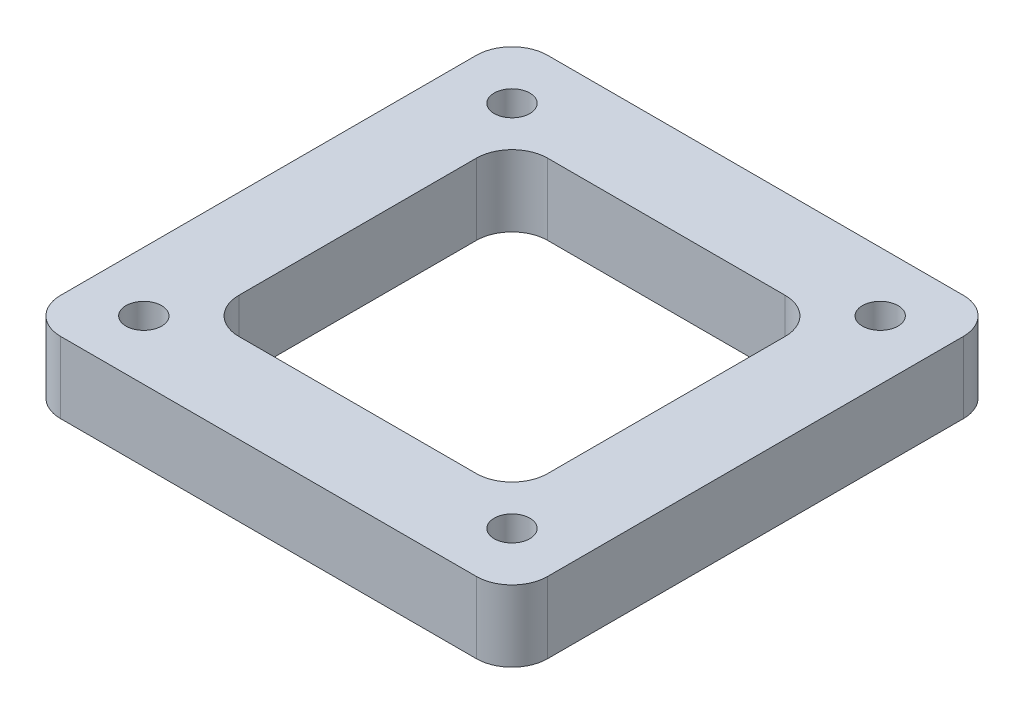
ISO-10303-21;
HEADER;
FILE_DESCRIPTION(('STEP AP214'),'2;1');
FILE_NAME('part.step','',(''),(''),'','','');
FILE_SCHEMA(('AUTOMOTIVE_DESIGN { 1 0 10303 214 1 1 1 1 }'));
ENDSEC;
DATA;
#1=APPLICATION_CONTEXT('core data for automotive mechanical design processes');
#2=APPLICATION_PROTOCOL_DEFINITION('international standard','automotive_design',2000,#1);
#3=PRODUCT_CONTEXT('',#1,'mechanical');
#4=PRODUCT('Part','Part','',(#3));
#5=PRODUCT_RELATED_PRODUCT_CATEGORY('part','',(#4));
#6=PRODUCT_DEFINITION_FORMATION('','',#4);
#7=PRODUCT_DEFINITION_CONTEXT('part definition',#1,'design');
#8=PRODUCT_DEFINITION('design','',#6,#7);
#9=PRODUCT_DEFINITION_SHAPE('','',#8);
#10=(LENGTH_UNIT() NAMED_UNIT(*) SI_UNIT(.MILLI.,.METRE.));
#11=(NAMED_UNIT(*) PLANE_ANGLE_UNIT() SI_UNIT($,.RADIAN.));
#12=(NAMED_UNIT(*) SI_UNIT($,.STERADIAN.) SOLID_ANGLE_UNIT());
#13=UNCERTAINTY_MEASURE_WITH_UNIT(LENGTH_MEASURE(1.E-05),#10,'distance_accuracy_value','');
#14=(GEOMETRIC_REPRESENTATION_CONTEXT(3) GLOBAL_UNCERTAINTY_ASSIGNED_CONTEXT((#13)) GLOBAL_UNIT_ASSIGNED_CONTEXT((#10,
#11,#12)) REPRESENTATION_CONTEXT('',''));
#15=CARTESIAN_POINT('',(0.,0.,0.));
#16=DIRECTION('',(0.,0.,1.));
#17=DIRECTION('',(1.,0.,0.));
#18=AXIS2_PLACEMENT_3D('',#15,#16,#17);
#19=CARTESIAN_POINT('',(0.,6.,0.));
#20=DIRECTION('',(0.,1.,0.));
#21=DIRECTION('',(0.,0.,1.));
#22=AXIS2_PLACEMENT_3D('',#19,#20,#21);
#23=PLANE('',#22);
#24=CARTESIAN_POINT('',(15.5,6.,-15.5));
#25=DIRECTION('',(0.,1.,0.));
#26=DIRECTION('',(0.,0.,1.));
#27=AXIS2_PLACEMENT_3D('',#24,#25,#26);
#28=CIRCLE('',#27,1.5);
#29=CARTESIAN_POINT('',(15.5,6.,-14.));
#30=VERTEX_POINT('',#29);
#31=EDGE_CURVE('E336',#30,#30,#28,.T.);
#32=ORIENTED_EDGE('',*,*,#31,.F.);
#33=EDGE_LOOP('',(#32));
#34=FACE_BOUND('',#33,.T.);
#35=CARTESIAN_POINT('',(-15.5,6.,15.5));
#36=DIRECTION('',(0.,1.,0.));
#37=DIRECTION('',(0.,0.,1.));
#38=AXIS2_PLACEMENT_3D('',#35,#36,#37);
#39=CIRCLE('',#38,1.5);
#40=CARTESIAN_POINT('',(-15.5,6.,17.));
#41=VERTEX_POINT('',#40);
#42=EDGE_CURVE('E327',#41,#41,#39,.T.);
#43=ORIENTED_EDGE('',*,*,#42,.F.);
#44=EDGE_LOOP('',(#43));
#45=FACE_BOUND('',#44,.T.);
#46=CARTESIAN_POINT('',(15.5,6.,15.5));
#47=DIRECTION('',(0.,1.,0.));
#48=DIRECTION('',(0.,0.,1.));
#49=AXIS2_PLACEMENT_3D('',#46,#47,#48);
#50=CIRCLE('',#49,1.5);
#51=CARTESIAN_POINT('',(15.5,6.,17.));
#52=VERTEX_POINT('',#51);
#53=EDGE_CURVE('E317',#52,#52,#50,.T.);
#54=ORIENTED_EDGE('',*,*,#53,.F.);
#55=EDGE_LOOP('',(#54));
#56=FACE_BOUND('',#55,.T.);
#57=CARTESIAN_POINT('',(-15.5,6.,-15.5));
#58=DIRECTION('',(0.,1.,0.));
#59=DIRECTION('',(0.,0.,1.));
#60=AXIS2_PLACEMENT_3D('',#57,#58,#59);
#61=CIRCLE('',#60,1.5);
#62=CARTESIAN_POINT('',(-15.5,6.,-14.));
#63=VERTEX_POINT('',#62);
#64=EDGE_CURVE('E347',#63,#63,#61,.T.);
#65=ORIENTED_EDGE('',*,*,#64,.F.);
#66=EDGE_LOOP('',(#65));
#67=FACE_BOUND('',#66,.T.);
#68=DIRECTION('',(0.,0.,-1.));
#69=VECTOR('',#68,1.);
#70=CARTESIAN_POINT('',(20.5,6.,-20.5));
#71=LINE('',#70,#69);
#72=CARTESIAN_POINT('',(20.5,6.,17.5));
#73=VERTEX_POINT('',#72);
#74=CARTESIAN_POINT('',(20.5,6.,-17.5));
#75=VERTEX_POINT('',#74);
#76=EDGE_CURVE('E355',#73,#75,#71,.T.);
#77=ORIENTED_EDGE('',*,*,#76,.T.);
#78=CARTESIAN_POINT('',(17.5,6.,-17.5));
#79=DIRECTION('',(0.,1.,0.));
#80=DIRECTION('',(0.,0.,1.));
#81=AXIS2_PLACEMENT_3D('',#78,#79,#80);
#82=CIRCLE('',#81,3.);
#83=CARTESIAN_POINT('',(17.5,6.,-20.5));
#84=VERTEX_POINT('',#83);
#85=EDGE_CURVE('E251',#75,#84,#82,.T.);
#86=ORIENTED_EDGE('',*,*,#85,.T.);
#87=DIRECTION('',(-1.,0.,0.));
#88=VECTOR('',#87,1.);
#89=CARTESIAN_POINT('',(-20.5,6.,-20.5));
#90=LINE('',#89,#88);
#91=CARTESIAN_POINT('',(-17.5,6.,-20.5));
#92=VERTEX_POINT('',#91);
#93=EDGE_CURVE('E359',#84,#92,#90,.T.);
#94=ORIENTED_EDGE('',*,*,#93,.T.);
#95=CARTESIAN_POINT('',(-17.5,6.,-17.5));
#96=DIRECTION('',(0.,1.,0.));
#97=DIRECTION('',(0.,0.,1.));
#98=AXIS2_PLACEMENT_3D('',#95,#96,#97);
#99=CIRCLE('',#98,3.);
#100=CARTESIAN_POINT('',(-20.5,6.,-17.5));
#101=VERTEX_POINT('',#100);
#102=EDGE_CURVE('E245',#92,#101,#99,.T.);
#103=ORIENTED_EDGE('',*,*,#102,.T.);
#104=DIRECTION('',(0.,0.,1.));
#105=VECTOR('',#104,1.);
#106=CARTESIAN_POINT('',(-20.5,6.,-20.5));
#107=LINE('',#106,#105);
#108=CARTESIAN_POINT('',(-20.5,6.,17.5));
#109=VERTEX_POINT('',#108);
#110=EDGE_CURVE('E192',#101,#109,#107,.T.);
#111=ORIENTED_EDGE('',*,*,#110,.T.);
#112=CARTESIAN_POINT('',(-17.5,6.,17.5));
#113=DIRECTION('',(0.,1.,0.));
#114=DIRECTION('',(0.,0.,1.));
#115=AXIS2_PLACEMENT_3D('',#112,#113,#114);
#116=CIRCLE('',#115,3.);
#117=CARTESIAN_POINT('',(-17.5,6.,20.5));
#118=VERTEX_POINT('',#117);
#119=EDGE_CURVE('E66',#109,#118,#116,.T.);
#120=ORIENTED_EDGE('',*,*,#119,.T.);
#121=DIRECTION('',(1.,0.,0.));
#122=VECTOR('',#121,1.);
#123=CARTESIAN_POINT('',(-20.5,6.,20.5));
#124=LINE('',#123,#122);
#125=CARTESIAN_POINT('',(17.5,6.,20.5));
#126=VERTEX_POINT('',#125);
#127=EDGE_CURVE('E186',#118,#126,#124,.T.);
#128=ORIENTED_EDGE('',*,*,#127,.T.);
#129=CARTESIAN_POINT('',(17.5,6.,17.5));
#130=DIRECTION('',(0.,1.,0.));
#131=DIRECTION('',(0.,0.,1.));
#132=AXIS2_PLACEMENT_3D('',#129,#130,#131);
#133=CIRCLE('',#132,3.);
#134=EDGE_CURVE('E248',#126,#73,#133,.T.);
#135=ORIENTED_EDGE('',*,*,#134,.T.);
#136=EDGE_LOOP('',(#77,#86,#94,#103,#111,#120,#128,#135));
#137=FACE_BOUND('',#136,.T.);
#138=DIRECTION('',(-1.,0.,0.));
#139=VECTOR('',#138,1.);
#140=CARTESIAN_POINT('',(-13.,6.,-13.));
#141=LINE('',#140,#139);
#142=CARTESIAN_POINT('',(9.99999999999999,6.,-13.));
#143=VERTEX_POINT('',#142);
#144=CARTESIAN_POINT('',(-10.,6.,-13.));
#145=VERTEX_POINT('',#144);
#146=EDGE_CURVE('E300',#143,#145,#141,.T.);
#147=ORIENTED_EDGE('',*,*,#146,.F.);
#148=CARTESIAN_POINT('',(9.99999999999999,6.,-10.));
#149=DIRECTION('',(0.,1.,0.));
#150=DIRECTION('',(0.,0.,1.));
#151=AXIS2_PLACEMENT_3D('',#148,#149,#150);
#152=CIRCLE('',#151,3.);
#153=CARTESIAN_POINT('',(13.,6.,-10.));
#154=VERTEX_POINT('',#153);
#155=EDGE_CURVE('E170',#143,#154,#152,.F.);
#156=ORIENTED_EDGE('',*,*,#155,.T.);
#157=DIRECTION('',(0.,0.,-1.));
#158=VECTOR('',#157,1.);
#159=CARTESIAN_POINT('',(13.,6.,-13.));
#160=LINE('',#159,#158);
#161=CARTESIAN_POINT('',(13.,6.,9.99999999999999));
#162=VERTEX_POINT('',#161);
#163=EDGE_CURVE('E307',#162,#154,#160,.T.);
#164=ORIENTED_EDGE('',*,*,#163,.F.);
#165=CARTESIAN_POINT('',(9.99999999999999,6.,10.));
#166=DIRECTION('',(0.,1.,0.));
#167=DIRECTION('',(0.,0.,1.));
#168=AXIS2_PLACEMENT_3D('',#165,#166,#167);
#169=CIRCLE('',#168,3.);
#170=CARTESIAN_POINT('',(9.99999999999999,6.,13.));
#171=VERTEX_POINT('',#170);
#172=EDGE_CURVE('E169',#162,#171,#169,.F.);
#173=ORIENTED_EDGE('',*,*,#172,.T.);
#174=DIRECTION('',(1.,0.,0.));
#175=VECTOR('',#174,1.);
#176=CARTESIAN_POINT('',(-13.,6.,13.));
#177=LINE('',#176,#175);
#178=CARTESIAN_POINT('',(-10.,6.,13.));
#179=VERTEX_POINT('',#178);
#180=EDGE_CURVE('E311',#179,#171,#177,.T.);
#181=ORIENTED_EDGE('',*,*,#180,.F.);
#182=CARTESIAN_POINT('',(-10.,6.,10.));
#183=DIRECTION('',(0.,1.,0.));
#184=DIRECTION('',(0.,0.,1.));
#185=AXIS2_PLACEMENT_3D('',#182,#183,#184);
#186=CIRCLE('',#185,3.);
#187=CARTESIAN_POINT('',(-13.,6.,9.99999999999999));
#188=VERTEX_POINT('',#187);
#189=EDGE_CURVE('E277',#179,#188,#186,.F.);
#190=ORIENTED_EDGE('',*,*,#189,.T.);
#191=DIRECTION('',(0.,0.,1.));
#192=VECTOR('',#191,1.);
#193=CARTESIAN_POINT('',(-13.,6.,-13.));
#194=LINE('',#193,#192);
#195=CARTESIAN_POINT('',(-13.,6.,-10.));
#196=VERTEX_POINT('',#195);
#197=EDGE_CURVE('E302',#196,#188,#194,.T.);
#198=ORIENTED_EDGE('',*,*,#197,.F.);
#199=CARTESIAN_POINT('',(-10.,6.,-10.));
#200=DIRECTION('',(0.,1.,0.));
#201=DIRECTION('',(0.,0.,1.));
#202=AXIS2_PLACEMENT_3D('',#199,#200,#201);
#203=CIRCLE('',#202,3.);
#204=EDGE_CURVE('E11',#196,#145,#203,.F.);
#205=ORIENTED_EDGE('',*,*,#204,.T.);
#206=EDGE_LOOP('',(#147,#156,#164,#173,#181,#190,#198,#205));
#207=FACE_BOUND('',#206,.T.);
#208=ADVANCED_FACE('F43',(#34,#45,#56,#67,#137,#207),#23,.T.);
#209=CARTESIAN_POINT('',(0.,0.,0.));
#210=DIRECTION('',(0.,1.,0.));
#211=DIRECTION('',(0.,0.,1.));
#212=AXIS2_PLACEMENT_3D('',#209,#210,#211);
#213=PLANE('',#212);
#214=DIRECTION('',(-1.,0.,0.));
#215=VECTOR('',#214,1.);
#216=CARTESIAN_POINT('',(-20.5,0.,-20.5));
#217=LINE('',#216,#215);
#218=CARTESIAN_POINT('',(17.5,0.,-20.5));
#219=VERTEX_POINT('',#218);
#220=CARTESIAN_POINT('',(-17.5,0.,-20.5));
#221=VERTEX_POINT('',#220);
#222=EDGE_CURVE('E368',#219,#221,#217,.T.);
#223=ORIENTED_EDGE('',*,*,#222,.F.);
#224=CARTESIAN_POINT('',(17.5,0.,-17.5));
#225=DIRECTION('',(0.,1.,0.));
#226=DIRECTION('',(0.,0.,1.));
#227=AXIS2_PLACEMENT_3D('',#224,#225,#226);
#228=CIRCLE('',#227,3.);
#229=CARTESIAN_POINT('',(20.5,0.,-17.5));
#230=VERTEX_POINT('',#229);
#231=EDGE_CURVE('E233',#219,#230,#228,.F.);
#232=ORIENTED_EDGE('',*,*,#231,.T.);
#233=DIRECTION('',(0.,0.,-1.));
#234=VECTOR('',#233,1.);
#235=CARTESIAN_POINT('',(20.5,0.,-20.5));
#236=LINE('',#235,#234);
#237=CARTESIAN_POINT('',(20.5,0.,17.5));
#238=VERTEX_POINT('',#237);
#239=EDGE_CURVE('E351',#238,#230,#236,.T.);
#240=ORIENTED_EDGE('',*,*,#239,.F.);
#241=CARTESIAN_POINT('',(17.5,0.,17.5));
#242=DIRECTION('',(0.,1.,0.));
#243=DIRECTION('',(0.,0.,1.));
#244=AXIS2_PLACEMENT_3D('',#241,#242,#243);
#245=CIRCLE('',#244,3.);
#246=CARTESIAN_POINT('',(17.5,0.,20.5));
#247=VERTEX_POINT('',#246);
#248=EDGE_CURVE('E230',#238,#247,#245,.F.);
#249=ORIENTED_EDGE('',*,*,#248,.T.);
#250=DIRECTION('',(1.,0.,0.));
#251=VECTOR('',#250,1.);
#252=CARTESIAN_POINT('',(-20.5,0.,20.5));
#253=LINE('',#252,#251);
#254=CARTESIAN_POINT('',(-17.5,0.,20.5));
#255=VERTEX_POINT('',#254);
#256=EDGE_CURVE('E195',#255,#247,#253,.T.);
#257=ORIENTED_EDGE('',*,*,#256,.F.);
#258=CARTESIAN_POINT('',(-17.5,0.,17.5));
#259=DIRECTION('',(0.,1.,0.));
#260=DIRECTION('',(0.,0.,1.));
#261=AXIS2_PLACEMENT_3D('',#258,#259,#260);
#262=CIRCLE('',#261,3.);
#263=CARTESIAN_POINT('',(-20.5,0.,17.5));
#264=VERTEX_POINT('',#263);
#265=EDGE_CURVE('E224',#255,#264,#262,.F.);
#266=ORIENTED_EDGE('',*,*,#265,.T.);
#267=DIRECTION('',(0.,0.,1.));
#268=VECTOR('',#267,1.);
#269=CARTESIAN_POINT('',(-20.5,0.,-20.5));
#270=LINE('',#269,#268);
#271=CARTESIAN_POINT('',(-20.5,0.,-17.5));
#272=VERTEX_POINT('',#271);
#273=EDGE_CURVE('E371',#272,#264,#270,.T.);
#274=ORIENTED_EDGE('',*,*,#273,.F.);
#275=CARTESIAN_POINT('',(-17.5,0.,-17.5));
#276=DIRECTION('',(0.,1.,0.));
#277=DIRECTION('',(0.,0.,1.));
#278=AXIS2_PLACEMENT_3D('',#275,#276,#277);
#279=CIRCLE('',#278,3.);
#280=EDGE_CURVE('E227',#272,#221,#279,.F.);
#281=ORIENTED_EDGE('',*,*,#280,.T.);
#282=EDGE_LOOP('',(#223,#232,#240,#249,#257,#266,#274,#281));
#283=FACE_BOUND('',#282,.T.);
#284=CARTESIAN_POINT('',(-15.5,0.,-15.5));
#285=DIRECTION('',(0.,1.,0.));
#286=DIRECTION('',(0.,0.,1.));
#287=AXIS2_PLACEMENT_3D('',#284,#285,#286);
#288=CIRCLE('',#287,1.5);
#289=CARTESIAN_POINT('',(-15.5,0.,-14.));
#290=VERTEX_POINT('',#289);
#291=EDGE_CURVE('E335',#290,#290,#288,.T.);
#292=ORIENTED_EDGE('',*,*,#291,.T.);
#293=EDGE_LOOP('',(#292));
#294=FACE_BOUND('',#293,.T.);
#295=CARTESIAN_POINT('',(15.5,0.,15.5));
#296=DIRECTION('',(0.,1.,0.));
#297=DIRECTION('',(0.,0.,1.));
#298=AXIS2_PLACEMENT_3D('',#295,#296,#297);
#299=CIRCLE('',#298,1.5);
#300=CARTESIAN_POINT('',(15.5,0.,17.));
#301=VERTEX_POINT('',#300);
#302=EDGE_CURVE('E323',#301,#301,#299,.T.);
#303=ORIENTED_EDGE('',*,*,#302,.T.);
#304=EDGE_LOOP('',(#303));
#305=FACE_BOUND('',#304,.T.);
#306=CARTESIAN_POINT('',(-15.5,0.,15.5));
#307=DIRECTION('',(0.,1.,0.));
#308=DIRECTION('',(0.,0.,1.));
#309=AXIS2_PLACEMENT_3D('',#306,#307,#308);
#310=CIRCLE('',#309,1.5);
#311=CARTESIAN_POINT('',(-15.5,0.,17.));
#312=VERTEX_POINT('',#311);
#313=EDGE_CURVE('E340',#312,#312,#310,.T.);
#314=ORIENTED_EDGE('',*,*,#313,.T.);
#315=EDGE_LOOP('',(#314));
#316=FACE_BOUND('',#315,.T.);
#317=CARTESIAN_POINT('',(15.5,0.,-15.5));
#318=DIRECTION('',(0.,1.,0.));
#319=DIRECTION('',(0.,0.,1.));
#320=AXIS2_PLACEMENT_3D('',#317,#318,#319);
#321=CIRCLE('',#320,1.5);
#322=CARTESIAN_POINT('',(15.5,0.,-14.));
#323=VERTEX_POINT('',#322);
#324=EDGE_CURVE('E331',#323,#323,#321,.T.);
#325=ORIENTED_EDGE('',*,*,#324,.T.);
#326=EDGE_LOOP('',(#325));
#327=FACE_BOUND('',#326,.T.);
#328=DIRECTION('',(1.,0.,0.));
#329=VECTOR('',#328,1.);
#330=CARTESIAN_POINT('',(-13.,0.,13.));
#331=LINE('',#330,#329);
#332=CARTESIAN_POINT('',(-10.,0.,13.));
#333=VERTEX_POINT('',#332);
#334=CARTESIAN_POINT('',(9.99999999999999,0.,13.));
#335=VERTEX_POINT('',#334);
#336=EDGE_CURVE('E163',#333,#335,#331,.T.);
#337=ORIENTED_EDGE('',*,*,#336,.T.);
#338=CARTESIAN_POINT('',(9.99999999999999,0.,10.));
#339=DIRECTION('',(0.,1.,0.));
#340=DIRECTION('',(0.,0.,1.));
#341=AXIS2_PLACEMENT_3D('',#338,#339,#340);
#342=CIRCLE('',#341,3.);
#343=CARTESIAN_POINT('',(13.,0.,9.99999999999999));
#344=VERTEX_POINT('',#343);
#345=EDGE_CURVE('E158',#335,#344,#342,.T.);
#346=ORIENTED_EDGE('',*,*,#345,.T.);
#347=DIRECTION('',(0.,0.,-1.));
#348=VECTOR('',#347,1.);
#349=CARTESIAN_POINT('',(13.,0.,-13.));
#350=LINE('',#349,#348);
#351=CARTESIAN_POINT('',(13.,0.,-10.));
#352=VERTEX_POINT('',#351);
#353=EDGE_CURVE('E161',#344,#352,#350,.T.);
#354=ORIENTED_EDGE('',*,*,#353,.T.);
#355=CARTESIAN_POINT('',(9.99999999999999,0.,-10.));
#356=DIRECTION('',(0.,1.,0.));
#357=DIRECTION('',(0.,0.,1.));
#358=AXIS2_PLACEMENT_3D('',#355,#356,#357);
#359=CIRCLE('',#358,3.);
#360=CARTESIAN_POINT('',(9.99999999999999,0.,-13.));
#361=VERTEX_POINT('',#360);
#362=EDGE_CURVE('E267',#352,#361,#359,.T.);
#363=ORIENTED_EDGE('',*,*,#362,.T.);
#364=DIRECTION('',(-1.,0.,0.));
#365=VECTOR('',#364,1.);
#366=CARTESIAN_POINT('',(-13.,0.,-13.));
#367=LINE('',#366,#365);
#368=CARTESIAN_POINT('',(-10.,0.,-13.));
#369=VERTEX_POINT('',#368);
#370=EDGE_CURVE('E181',#361,#369,#367,.T.);
#371=ORIENTED_EDGE('',*,*,#370,.T.);
#372=CARTESIAN_POINT('',(-10.,0.,-10.));
#373=DIRECTION('',(0.,1.,0.));
#374=DIRECTION('',(0.,0.,1.));
#375=AXIS2_PLACEMENT_3D('',#372,#373,#374);
#376=CIRCLE('',#375,3.);
#377=CARTESIAN_POINT('',(-13.,0.,-10.));
#378=VERTEX_POINT('',#377);
#379=EDGE_CURVE('E52',#369,#378,#376,.T.);
#380=ORIENTED_EDGE('',*,*,#379,.T.);
#381=DIRECTION('',(0.,0.,1.));
#382=VECTOR('',#381,1.);
#383=CARTESIAN_POINT('',(-13.,0.,-13.));
#384=LINE('',#383,#382);
#385=CARTESIAN_POINT('',(-13.,0.,9.99999999999999));
#386=VERTEX_POINT('',#385);
#387=EDGE_CURVE('E283',#378,#386,#384,.T.);
#388=ORIENTED_EDGE('',*,*,#387,.T.);
#389=CARTESIAN_POINT('',(-10.,0.,10.));
#390=DIRECTION('',(0.,1.,0.));
#391=DIRECTION('',(0.,0.,1.));
#392=AXIS2_PLACEMENT_3D('',#389,#390,#391);
#393=CIRCLE('',#392,3.);
#394=EDGE_CURVE('E274',#386,#333,#393,.T.);
#395=ORIENTED_EDGE('',*,*,#394,.T.);
#396=EDGE_LOOP('',(#337,#346,#354,#363,#371,#380,#388,#395));
#397=FACE_BOUND('',#396,.T.);
#398=ADVANCED_FACE('F160',(#283,#294,#305,#316,#327,#397),#213,.F.);
#399=CARTESIAN_POINT('',(20.5,6.,-20.5));
#400=DIRECTION('',(-1.,0.,0.));
#401=DIRECTION('',(0.,0.,1.));
#402=AXIS2_PLACEMENT_3D('',#399,#400,#401);
#403=PLANE('',#402);
#404=ORIENTED_EDGE('',*,*,#239,.T.);
#405=DIRECTION('',(0.,-1.,0.));
#406=VECTOR('',#405,1.);
#407=CARTESIAN_POINT('',(20.5,6.,-17.5));
#408=LINE('',#407,#406);
#409=EDGE_CURVE('E240',#230,#75,#408,.F.);
#410=ORIENTED_EDGE('',*,*,#409,.T.);
#411=ORIENTED_EDGE('',*,*,#76,.F.);
#412=DIRECTION('',(0.,-1.,0.));
#413=VECTOR('',#412,1.);
#414=CARTESIAN_POINT('',(20.5,6.,17.5));
#415=LINE('',#414,#413);
#416=EDGE_CURVE('E236',#73,#238,#415,.T.);
#417=ORIENTED_EDGE('',*,*,#416,.T.);
#418=EDGE_LOOP('',(#404,#410,#411,#417));
#419=FACE_BOUND('',#418,.T.);
#420=ADVANCED_FACE('F389',(#419),#403,.F.);
#421=CARTESIAN_POINT('',(-20.5,6.,-20.5));
#422=DIRECTION('',(0.,0.,1.));
#423=DIRECTION('',(1.,0.,0.));
#424=AXIS2_PLACEMENT_3D('',#421,#422,#423);
#425=PLANE('',#424);
#426=ORIENTED_EDGE('',*,*,#93,.F.);
#427=DIRECTION('',(0.,-1.,0.));
#428=VECTOR('',#427,1.);
#429=CARTESIAN_POINT('',(17.5,6.,-20.5));
#430=LINE('',#429,#428);
#431=EDGE_CURVE('E220',#84,#219,#430,.T.);
#432=ORIENTED_EDGE('',*,*,#431,.T.);
#433=ORIENTED_EDGE('',*,*,#222,.T.);
#434=DIRECTION('',(0.,-1.,0.));
#435=VECTOR('',#434,1.);
#436=CARTESIAN_POINT('',(-17.5,6.,-20.5));
#437=LINE('',#436,#435);
#438=EDGE_CURVE('E217',#221,#92,#437,.F.);
#439=ORIENTED_EDGE('',*,*,#438,.T.);
#440=EDGE_LOOP('',(#426,#432,#433,#439));
#441=FACE_BOUND('',#440,.T.);
#442=ADVANCED_FACE('F398',(#441),#425,.F.);
#443=CARTESIAN_POINT('',(-20.5,6.,-20.5));
#444=DIRECTION('',(1.,0.,0.));
#445=DIRECTION('',(0.,0.,-1.));
#446=AXIS2_PLACEMENT_3D('',#443,#444,#445);
#447=PLANE('',#446);
#448=ORIENTED_EDGE('',*,*,#110,.F.);
#449=DIRECTION('',(0.,-1.,0.));
#450=VECTOR('',#449,1.);
#451=CARTESIAN_POINT('',(-20.5,6.,-17.5));
#452=LINE('',#451,#450);
#453=EDGE_CURVE('E263',#101,#272,#452,.T.);
#454=ORIENTED_EDGE('',*,*,#453,.T.);
#455=ORIENTED_EDGE('',*,*,#273,.T.);
#456=DIRECTION('',(0.,-1.,0.));
#457=VECTOR('',#456,1.);
#458=CARTESIAN_POINT('',(-20.5,6.,17.5));
#459=LINE('',#458,#457);
#460=EDGE_CURVE('E260',#264,#109,#459,.F.);
#461=ORIENTED_EDGE('',*,*,#460,.T.);
#462=EDGE_LOOP('',(#448,#454,#455,#461));
#463=FACE_BOUND('',#462,.T.);
#464=ADVANCED_FACE('F405',(#463),#447,.F.);
#465=CARTESIAN_POINT('',(-20.5,6.,20.5));
#466=DIRECTION('',(0.,0.,-1.));
#467=DIRECTION('',(-1.,0.,0.));
#468=AXIS2_PLACEMENT_3D('',#465,#466,#467);
#469=PLANE('',#468);
#470=ORIENTED_EDGE('',*,*,#256,.T.);
#471=DIRECTION('',(0.,-1.,0.));
#472=VECTOR('',#471,1.);
#473=CARTESIAN_POINT('',(17.5,6.,20.5));
#474=LINE('',#473,#472);
#475=EDGE_CURVE('E59',#247,#126,#474,.F.);
#476=ORIENTED_EDGE('',*,*,#475,.T.);
#477=ORIENTED_EDGE('',*,*,#127,.F.);
#478=DIRECTION('',(0.,-1.,0.));
#479=VECTOR('',#478,1.);
#480=CARTESIAN_POINT('',(-17.5,6.,20.5));
#481=LINE('',#480,#479);
#482=EDGE_CURVE('E254',#118,#255,#481,.T.);
#483=ORIENTED_EDGE('',*,*,#482,.T.);
#484=EDGE_LOOP('',(#470,#476,#477,#483));
#485=FACE_BOUND('',#484,.T.);
#486=ADVANCED_FACE('F379',(#485),#469,.F.);
#487=CARTESIAN_POINT('',(-15.5,6.,-15.5));
#488=DIRECTION('',(0.,-1.,0.));
#489=DIRECTION('',(0.,0.,-1.));
#490=AXIS2_PLACEMENT_3D('',#487,#488,#489);
#491=CYLINDRICAL_SURFACE('',#490,1.5);
#492=ORIENTED_EDGE('',*,*,#64,.T.);
#493=EDGE_LOOP('',(#492));
#494=FACE_BOUND('',#493,.T.);
#495=ORIENTED_EDGE('',*,*,#291,.F.);
#496=EDGE_LOOP('',(#495));
#497=FACE_BOUND('',#496,.T.);
#498=ADVANCED_FACE('F440',(#494,#497),#491,.F.);
#499=CARTESIAN_POINT('',(15.5,6.,15.5));
#500=DIRECTION('',(0.,-1.,0.));
#501=DIRECTION('',(0.,0.,-1.));
#502=AXIS2_PLACEMENT_3D('',#499,#500,#501);
#503=CYLINDRICAL_SURFACE('',#502,1.5);
#504=ORIENTED_EDGE('',*,*,#53,.T.);
#505=EDGE_LOOP('',(#504));
#506=FACE_BOUND('',#505,.T.);
#507=ORIENTED_EDGE('',*,*,#302,.F.);
#508=EDGE_LOOP('',(#507));
#509=FACE_BOUND('',#508,.T.);
#510=ADVANCED_FACE('F428',(#506,#509),#503,.F.);
#511=CARTESIAN_POINT('',(-15.5,6.,15.5));
#512=DIRECTION('',(0.,-1.,0.));
#513=DIRECTION('',(0.,0.,-1.));
#514=AXIS2_PLACEMENT_3D('',#511,#512,#513);
#515=CYLINDRICAL_SURFACE('',#514,1.5);
#516=ORIENTED_EDGE('',*,*,#42,.T.);
#517=EDGE_LOOP('',(#516));
#518=FACE_BOUND('',#517,.T.);
#519=ORIENTED_EDGE('',*,*,#313,.F.);
#520=EDGE_LOOP('',(#519));
#521=FACE_BOUND('',#520,.T.);
#522=ADVANCED_FACE('F420',(#518,#521),#515,.F.);
#523=CARTESIAN_POINT('',(15.5,6.,-15.5));
#524=DIRECTION('',(0.,-1.,0.));
#525=DIRECTION('',(0.,0.,-1.));
#526=AXIS2_PLACEMENT_3D('',#523,#524,#525);
#527=CYLINDRICAL_SURFACE('',#526,1.5);
#528=ORIENTED_EDGE('',*,*,#31,.T.);
#529=EDGE_LOOP('',(#528));
#530=FACE_BOUND('',#529,.T.);
#531=ORIENTED_EDGE('',*,*,#324,.F.);
#532=EDGE_LOOP('',(#531));
#533=FACE_BOUND('',#532,.T.);
#534=ADVANCED_FACE('F418',(#530,#533),#527,.F.);
#535=CARTESIAN_POINT('',(13.,6.,-13.));
#536=DIRECTION('',(-1.,0.,0.));
#537=DIRECTION('',(0.,0.,1.));
#538=AXIS2_PLACEMENT_3D('',#535,#536,#537);
#539=PLANE('',#538);
#540=ORIENTED_EDGE('',*,*,#163,.T.);
#541=DIRECTION('',(0.,-1.,0.));
#542=VECTOR('',#541,1.);
#543=CARTESIAN_POINT('',(13.,0.,-10.));
#544=LINE('',#543,#542);
#545=EDGE_CURVE('E179',#154,#352,#544,.T.);
#546=ORIENTED_EDGE('',*,*,#545,.T.);
#547=ORIENTED_EDGE('',*,*,#353,.F.);
#548=DIRECTION('',(0.,-1.,0.));
#549=VECTOR('',#548,1.);
#550=CARTESIAN_POINT('',(13.,6.,10.));
#551=LINE('',#550,#549);
#552=EDGE_CURVE('E176',#344,#162,#551,.F.);
#553=ORIENTED_EDGE('',*,*,#552,.T.);
#554=EDGE_LOOP('',(#540,#546,#547,#553));
#555=FACE_BOUND('',#554,.T.);
#556=ADVANCED_FACE('F175',(#555),#539,.T.);
#557=CARTESIAN_POINT('',(-13.,6.,-13.));
#558=DIRECTION('',(0.,0.,1.));
#559=DIRECTION('',(1.,0.,0.));
#560=AXIS2_PLACEMENT_3D('',#557,#558,#559);
#561=PLANE('',#560);
#562=ORIENTED_EDGE('',*,*,#370,.F.);
#563=DIRECTION('',(0.,-1.,0.));
#564=VECTOR('',#563,1.);
#565=CARTESIAN_POINT('',(9.99999999999999,6.,-13.));
#566=LINE('',#565,#564);
#567=EDGE_CURVE('E201',#361,#143,#566,.F.);
#568=ORIENTED_EDGE('',*,*,#567,.T.);
#569=ORIENTED_EDGE('',*,*,#146,.T.);
#570=DIRECTION('',(0.,-1.,0.));
#571=VECTOR('',#570,1.);
#572=CARTESIAN_POINT('',(-10.,0.,-13.));
#573=LINE('',#572,#571);
#574=EDGE_CURVE('E190',#145,#369,#573,.T.);
#575=ORIENTED_EDGE('',*,*,#574,.T.);
#576=EDGE_LOOP('',(#562,#568,#569,#575));
#577=FACE_BOUND('',#576,.T.);
#578=ADVANCED_FACE('F304',(#577),#561,.T.);
#579=CARTESIAN_POINT('',(-13.,6.,-13.));
#580=DIRECTION('',(1.,0.,0.));
#581=DIRECTION('',(0.,0.,-1.));
#582=AXIS2_PLACEMENT_3D('',#579,#580,#581);
#583=PLANE('',#582);
#584=ORIENTED_EDGE('',*,*,#197,.T.);
#585=DIRECTION('',(0.,-1.,0.));
#586=VECTOR('',#585,1.);
#587=CARTESIAN_POINT('',(-13.,0.,10.));
#588=LINE('',#587,#586);
#589=EDGE_CURVE('E213',#188,#386,#588,.T.);
#590=ORIENTED_EDGE('',*,*,#589,.T.);
#591=ORIENTED_EDGE('',*,*,#387,.F.);
#592=DIRECTION('',(0.,-1.,0.));
#593=VECTOR('',#592,1.);
#594=CARTESIAN_POINT('',(-13.,6.,-10.));
#595=LINE('',#594,#593);
#596=EDGE_CURVE('E210',#378,#196,#595,.F.);
#597=ORIENTED_EDGE('',*,*,#596,.T.);
#598=EDGE_LOOP('',(#584,#590,#591,#597));
#599=FACE_BOUND('',#598,.T.);
#600=ADVANCED_FACE('F290',(#599),#583,.T.);
#601=CARTESIAN_POINT('',(-13.,6.,13.));
#602=DIRECTION('',(0.,0.,-1.));
#603=DIRECTION('',(-1.,0.,0.));
#604=AXIS2_PLACEMENT_3D('',#601,#602,#603);
#605=PLANE('',#604);
#606=ORIENTED_EDGE('',*,*,#180,.T.);
#607=DIRECTION('',(0.,-1.,0.));
#608=VECTOR('',#607,1.);
#609=CARTESIAN_POINT('',(9.99999999999999,0.,13.));
#610=LINE('',#609,#608);
#611=EDGE_CURVE('E207',#171,#335,#610,.T.);
#612=ORIENTED_EDGE('',*,*,#611,.T.);
#613=ORIENTED_EDGE('',*,*,#336,.F.);
#614=DIRECTION('',(0.,-1.,0.));
#615=VECTOR('',#614,1.);
#616=CARTESIAN_POINT('',(-10.,6.,13.));
#617=LINE('',#616,#615);
#618=EDGE_CURVE('E204',#333,#179,#617,.F.);
#619=ORIENTED_EDGE('',*,*,#618,.T.);
#620=EDGE_LOOP('',(#606,#612,#613,#619));
#621=FACE_BOUND('',#620,.T.);
#622=ADVANCED_FACE('F453',(#621),#605,.T.);
#623=CARTESIAN_POINT('',(9.99999999999999,6.,-10.));
#624=DIRECTION('',(0.,1.,0.));
#625=DIRECTION('',(0.,0.,1.));
#626=AXIS2_PLACEMENT_3D('',#623,#624,#625);
#627=CYLINDRICAL_SURFACE('',#626,3.);
#628=ORIENTED_EDGE('',*,*,#155,.F.);
#629=ORIENTED_EDGE('',*,*,#567,.F.);
#630=ORIENTED_EDGE('',*,*,#362,.F.);
#631=ORIENTED_EDGE('',*,*,#545,.F.);
#632=EDGE_LOOP('',(#628,#629,#630,#631));
#633=FACE_BOUND('',#632,.T.);
#634=ADVANCED_FACE('F450',(#633),#627,.F.);
#635=CARTESIAN_POINT('',(9.99999999999999,6.,10.));
#636=DIRECTION('',(0.,1.,0.));
#637=DIRECTION('',(0.,0.,1.));
#638=AXIS2_PLACEMENT_3D('',#635,#636,#637);
#639=CYLINDRICAL_SURFACE('',#638,3.);
#640=ORIENTED_EDGE('',*,*,#172,.F.);
#641=ORIENTED_EDGE('',*,*,#552,.F.);
#642=ORIENTED_EDGE('',*,*,#345,.F.);
#643=ORIENTED_EDGE('',*,*,#611,.F.);
#644=EDGE_LOOP('',(#640,#641,#642,#643));
#645=FACE_BOUND('',#644,.T.);
#646=ADVANCED_FACE('F184',(#645),#639,.F.);
#647=CARTESIAN_POINT('',(-10.,6.,10.));
#648=DIRECTION('',(0.,1.,0.));
#649=DIRECTION('',(0.,0.,1.));
#650=AXIS2_PLACEMENT_3D('',#647,#648,#649);
#651=CYLINDRICAL_SURFACE('',#650,3.);
#652=ORIENTED_EDGE('',*,*,#189,.F.);
#653=ORIENTED_EDGE('',*,*,#618,.F.);
#654=ORIENTED_EDGE('',*,*,#394,.F.);
#655=ORIENTED_EDGE('',*,*,#589,.F.);
#656=EDGE_LOOP('',(#652,#653,#654,#655));
#657=FACE_BOUND('',#656,.T.);
#658=ADVANCED_FACE('F457',(#657),#651,.F.);
#659=CARTESIAN_POINT('',(-10.,6.,-10.));
#660=DIRECTION('',(0.,1.,0.));
#661=DIRECTION('',(0.,0.,1.));
#662=AXIS2_PLACEMENT_3D('',#659,#660,#661);
#663=CYLINDRICAL_SURFACE('',#662,3.);
#664=ORIENTED_EDGE('',*,*,#204,.F.);
#665=ORIENTED_EDGE('',*,*,#596,.F.);
#666=ORIENTED_EDGE('',*,*,#379,.F.);
#667=ORIENTED_EDGE('',*,*,#574,.F.);
#668=EDGE_LOOP('',(#664,#665,#666,#667));
#669=FACE_BOUND('',#668,.T.);
#670=ADVANCED_FACE('F296',(#669),#663,.F.);
#671=CARTESIAN_POINT('',(17.5,6.,-17.5));
#672=DIRECTION('',(0.,-1.,0.));
#673=DIRECTION('',(0.,0.,-1.));
#674=AXIS2_PLACEMENT_3D('',#671,#672,#673);
#675=CYLINDRICAL_SURFACE('',#674,3.);
#676=ORIENTED_EDGE('',*,*,#85,.F.);
#677=ORIENTED_EDGE('',*,*,#409,.F.);
#678=ORIENTED_EDGE('',*,*,#231,.F.);
#679=ORIENTED_EDGE('',*,*,#431,.F.);
#680=EDGE_LOOP('',(#676,#677,#678,#679));
#681=FACE_BOUND('',#680,.T.);
#682=ADVANCED_FACE('F393',(#681),#675,.T.);
#683=CARTESIAN_POINT('',(17.5,6.,17.5));
#684=DIRECTION('',(0.,-1.,0.));
#685=DIRECTION('',(0.,0.,-1.));
#686=AXIS2_PLACEMENT_3D('',#683,#684,#685);
#687=CYLINDRICAL_SURFACE('',#686,3.);
#688=ORIENTED_EDGE('',*,*,#134,.F.);
#689=ORIENTED_EDGE('',*,*,#475,.F.);
#690=ORIENTED_EDGE('',*,*,#248,.F.);
#691=ORIENTED_EDGE('',*,*,#416,.F.);
#692=EDGE_LOOP('',(#688,#689,#690,#691));
#693=FACE_BOUND('',#692,.T.);
#694=ADVANCED_FACE('F384',(#693),#687,.T.);
#695=CARTESIAN_POINT('',(-17.5,6.,-17.5));
#696=DIRECTION('',(0.,-1.,0.));
#697=DIRECTION('',(0.,0.,-1.));
#698=AXIS2_PLACEMENT_3D('',#695,#696,#697);
#699=CYLINDRICAL_SURFACE('',#698,3.);
#700=ORIENTED_EDGE('',*,*,#102,.F.);
#701=ORIENTED_EDGE('',*,*,#438,.F.);
#702=ORIENTED_EDGE('',*,*,#280,.F.);
#703=ORIENTED_EDGE('',*,*,#453,.F.);
#704=EDGE_LOOP('',(#700,#701,#702,#703));
#705=FACE_BOUND('',#704,.T.);
#706=ADVANCED_FACE('F402',(#705),#699,.T.);
#707=CARTESIAN_POINT('',(-17.5,6.,17.5));
#708=DIRECTION('',(0.,-1.,0.));
#709=DIRECTION('',(0.,0.,-1.));
#710=AXIS2_PLACEMENT_3D('',#707,#708,#709);
#711=CYLINDRICAL_SURFACE('',#710,3.);
#712=ORIENTED_EDGE('',*,*,#119,.F.);
#713=ORIENTED_EDGE('',*,*,#460,.F.);
#714=ORIENTED_EDGE('',*,*,#265,.F.);
#715=ORIENTED_EDGE('',*,*,#482,.F.);
#716=EDGE_LOOP('',(#712,#713,#714,#715));
#717=FACE_BOUND('',#716,.T.);
#718=ADVANCED_FACE('F45',(#717),#711,.T.);
#719=CLOSED_SHELL('',(#208,#398,#420,#442,#464,#486,#498,#510,#522,#534,#556,#578,#600,#622,
#634,#646,#658,#670,#682,#694,#706,#718));
#720=MANIFOLD_SOLID_BREP('B2',#719);
#721=ADVANCED_BREP_SHAPE_REPRESENTATION('',(#18,#720),#14);
#722=SHAPE_DEFINITION_REPRESENTATION(#9,#721);
ENDSEC;
END-ISO-10303-21;
